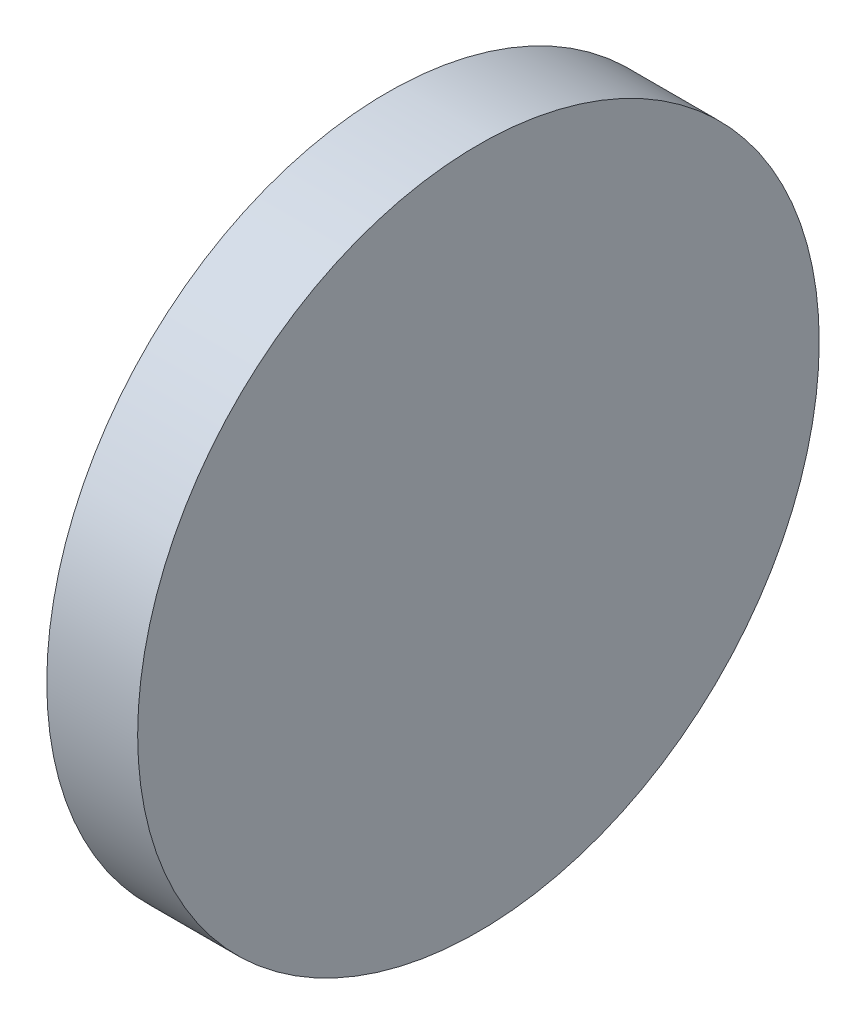
ISO-10303-21;
HEADER;
FILE_DESCRIPTION(('STEP AP214'),'2;1');
FILE_NAME('part.step','',(''),(''),'','','');
FILE_SCHEMA(('AUTOMOTIVE_DESIGN { 1 0 10303 214 1 1 1 1 }'));
ENDSEC;
DATA;
#1=APPLICATION_CONTEXT('core data for automotive mechanical design processes');
#2=APPLICATION_PROTOCOL_DEFINITION('international standard','automotive_design',2000,#1);
#3=PRODUCT_CONTEXT('',#1,'mechanical');
#4=PRODUCT('Part','Part','',(#3));
#5=PRODUCT_RELATED_PRODUCT_CATEGORY('part','',(#4));
#6=PRODUCT_DEFINITION_FORMATION('','',#4);
#7=PRODUCT_DEFINITION_CONTEXT('part definition',#1,'design');
#8=PRODUCT_DEFINITION('design','',#6,#7);
#9=PRODUCT_DEFINITION_SHAPE('','',#8);
#10=(LENGTH_UNIT() NAMED_UNIT(*) SI_UNIT(.MILLI.,.METRE.));
#11=(NAMED_UNIT(*) PLANE_ANGLE_UNIT() SI_UNIT($,.RADIAN.));
#12=(NAMED_UNIT(*) SI_UNIT($,.STERADIAN.) SOLID_ANGLE_UNIT());
#13=UNCERTAINTY_MEASURE_WITH_UNIT(LENGTH_MEASURE(1.E-05),#10,'distance_accuracy_value','');
#14=(GEOMETRIC_REPRESENTATION_CONTEXT(3) GLOBAL_UNCERTAINTY_ASSIGNED_CONTEXT((#13)) GLOBAL_UNIT_ASSIGNED_CONTEXT((#10,
#11,#12)) REPRESENTATION_CONTEXT('',''));
#15=CARTESIAN_POINT('',(0.,0.,0.));
#16=DIRECTION('',(0.,0.,1.));
#17=DIRECTION('',(1.,0.,0.));
#18=AXIS2_PLACEMENT_3D('',#15,#16,#17);
#19=CARTESIAN_POINT('',(20.,0.,0.));
#20=DIRECTION('',(-1.,0.,0.));
#21=DIRECTION('',(0.,0.,1.));
#22=AXIS2_PLACEMENT_3D('',#19,#20,#21);
#23=CYLINDRICAL_SURFACE('',#22,75.);
#24=CARTESIAN_POINT('',(20.,0.,0.));
#25=DIRECTION('',(1.,0.,0.));
#26=DIRECTION('',(0.,0.,-1.));
#27=AXIS2_PLACEMENT_3D('',#24,#25,#26);
#28=CIRCLE('',#27,75.);
#29=CARTESIAN_POINT('',(20.,0.,-75.));
#30=VERTEX_POINT('',#29);
#31=EDGE_CURVE('E10',#30,#30,#28,.T.);
#32=ORIENTED_EDGE('',*,*,#31,.F.);
#33=EDGE_LOOP('',(#32));
#34=FACE_BOUND('',#33,.T.);
#35=CARTESIAN_POINT('',(0.,0.,0.));
#36=DIRECTION('',(1.,0.,0.));
#37=DIRECTION('',(0.,0.,-1.));
#38=AXIS2_PLACEMENT_3D('',#35,#36,#37);
#39=CIRCLE('',#38,75.);
#40=CARTESIAN_POINT('',(0.,0.,-75.));
#41=VERTEX_POINT('',#40);
#42=EDGE_CURVE('E34',#41,#41,#39,.T.);
#43=ORIENTED_EDGE('',*,*,#42,.T.);
#44=EDGE_LOOP('',(#43));
#45=FACE_BOUND('',#44,.T.);
#46=ADVANCED_FACE('F31',(#34,#45),#23,.T.);
#47=CARTESIAN_POINT('',(20.,0.,0.));
#48=DIRECTION('',(1.,0.,0.));
#49=DIRECTION('',(0.,0.,-1.));
#50=AXIS2_PLACEMENT_3D('',#47,#48,#49);
#51=PLANE('',#50);
#52=ORIENTED_EDGE('',*,*,#31,.T.);
#53=EDGE_LOOP('',(#52));
#54=FACE_BOUND('',#53,.T.);
#55=ADVANCED_FACE('F46',(#54),#51,.T.);
#56=CARTESIAN_POINT('',(0.,0.,0.));
#57=DIRECTION('',(1.,0.,0.));
#58=DIRECTION('',(0.,0.,-1.));
#59=AXIS2_PLACEMENT_3D('',#56,#57,#58);
#60=PLANE('',#59);
#61=ORIENTED_EDGE('',*,*,#42,.F.);
#62=EDGE_LOOP('',(#61));
#63=FACE_BOUND('',#62,.T.);
#64=ADVANCED_FACE('F44',(#63),#60,.F.);
#65=CLOSED_SHELL('',(#46,#55,#64));
#66=MANIFOLD_SOLID_BREP('B2',#65);
#67=ADVANCED_BREP_SHAPE_REPRESENTATION('',(#18,#66),#14);
#68=SHAPE_DEFINITION_REPRESENTATION(#9,#67);
ENDSEC;
END-ISO-10303-21;
